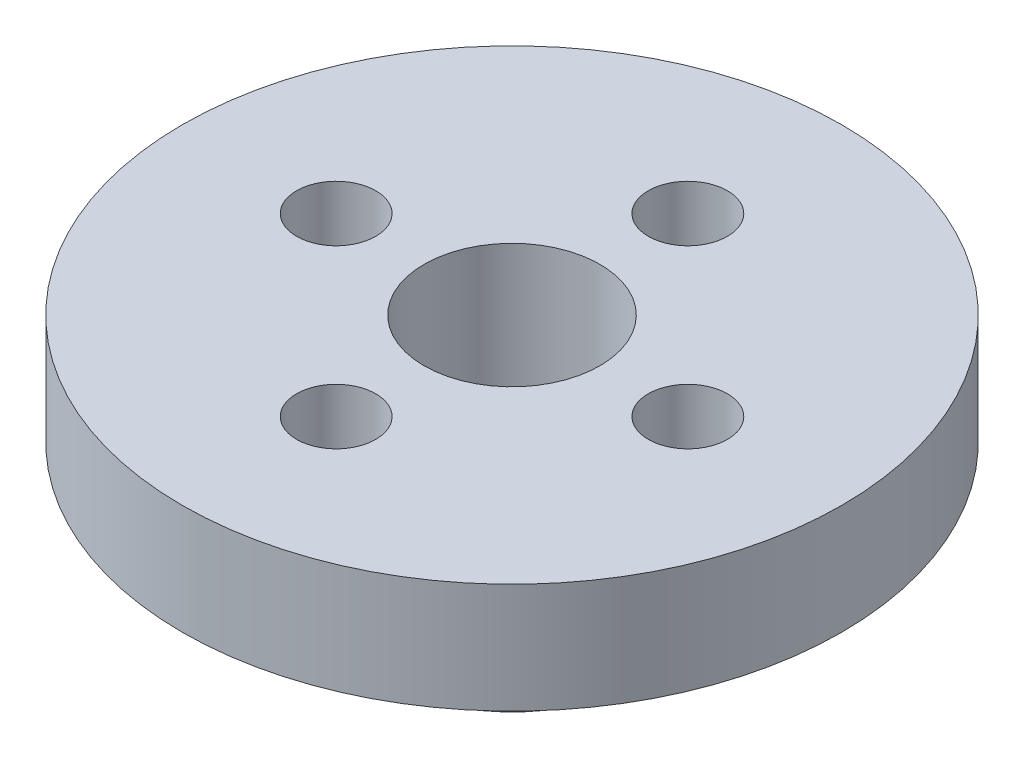
ISO-10303-21;
HEADER;
FILE_DESCRIPTION(('STEP AP214'),'2;1');
FILE_NAME('part.step','',(''),(''),'','','');
FILE_SCHEMA(('AUTOMOTIVE_DESIGN { 1 0 10303 214 1 1 1 1 }'));
ENDSEC;
DATA;
#1=APPLICATION_CONTEXT('core data for automotive mechanical design processes');
#2=APPLICATION_PROTOCOL_DEFINITION('international standard','automotive_design',2000,#1);
#3=PRODUCT_CONTEXT('',#1,'mechanical');
#4=PRODUCT('Part','Part','',(#3));
#5=PRODUCT_RELATED_PRODUCT_CATEGORY('part','',(#4));
#6=PRODUCT_DEFINITION_FORMATION('','',#4);
#7=PRODUCT_DEFINITION_CONTEXT('part definition',#1,'design');
#8=PRODUCT_DEFINITION('design','',#6,#7);
#9=PRODUCT_DEFINITION_SHAPE('','',#8);
#10=(LENGTH_UNIT() NAMED_UNIT(*) SI_UNIT(.MILLI.,.METRE.));
#11=(NAMED_UNIT(*) PLANE_ANGLE_UNIT() SI_UNIT($,.RADIAN.));
#12=(NAMED_UNIT(*) SI_UNIT($,.STERADIAN.) SOLID_ANGLE_UNIT());
#13=UNCERTAINTY_MEASURE_WITH_UNIT(LENGTH_MEASURE(1.E-05),#10,'distance_accuracy_value','');
#14=(GEOMETRIC_REPRESENTATION_CONTEXT(3) GLOBAL_UNCERTAINTY_ASSIGNED_CONTEXT((#13)) GLOBAL_UNIT_ASSIGNED_CONTEXT((#10,
#11,#12)) REPRESENTATION_CONTEXT('',''));
#15=CARTESIAN_POINT('',(0.,0.,0.));
#16=DIRECTION('',(0.,0.,1.));
#17=DIRECTION('',(1.,0.,0.));
#18=AXIS2_PLACEMENT_3D('',#15,#16,#17);
#19=CARTESIAN_POINT('',(0.,3.175,0.));
#20=DIRECTION('',(0.,-1.,0.));
#21=DIRECTION('',(0.,0.,-1.));
#22=AXIS2_PLACEMENT_3D('',#19,#20,#21);
#23=CYLINDRICAL_SURFACE('',#22,9.525);
#24=CARTESIAN_POINT('',(0.,3.175,0.));
#25=DIRECTION('',(0.,1.,0.));
#26=DIRECTION('',(0.,0.,1.));
#27=AXIS2_PLACEMENT_3D('',#24,#25,#26);
#28=CIRCLE('',#27,9.525);
#29=CARTESIAN_POINT('',(0.,3.175,9.525));
#30=VERTEX_POINT('',#29);
#31=EDGE_CURVE('E10',#30,#30,#28,.T.);
#32=ORIENTED_EDGE('',*,*,#31,.F.);
#33=EDGE_LOOP('',(#32));
#34=FACE_BOUND('',#33,.T.);
#35=CARTESIAN_POINT('',(0.,0.,0.));
#36=DIRECTION('',(0.,1.,0.));
#37=DIRECTION('',(0.,0.,1.));
#38=AXIS2_PLACEMENT_3D('',#35,#36,#37);
#39=CIRCLE('',#38,9.525);
#40=CARTESIAN_POINT('',(0.,0.,9.525));
#41=VERTEX_POINT('',#40);
#42=EDGE_CURVE('E40',#41,#41,#39,.T.);
#43=ORIENTED_EDGE('',*,*,#42,.T.);
#44=EDGE_LOOP('',(#43));
#45=FACE_BOUND('',#44,.T.);
#46=ADVANCED_FACE('F37',(#34,#45),#23,.T.);
#47=CARTESIAN_POINT('',(0.,3.175,0.));
#48=DIRECTION('',(0.,1.,0.));
#49=DIRECTION('',(0.,0.,1.));
#50=AXIS2_PLACEMENT_3D('',#47,#48,#49);
#51=PLANE('',#50);
#52=CARTESIAN_POINT('',(5.08,3.175,0.));
#53=DIRECTION('',(0.,1.,0.));
#54=DIRECTION('',(0.,0.,1.));
#55=AXIS2_PLACEMENT_3D('',#52,#53,#54);
#56=CIRCLE('',#55,1.143);
#57=CARTESIAN_POINT('',(5.08,3.175,1.143));
#58=VERTEX_POINT('',#57);
#59=EDGE_CURVE('E66',#58,#58,#56,.T.);
#60=ORIENTED_EDGE('',*,*,#59,.F.);
#61=EDGE_LOOP('',(#60));
#62=FACE_BOUND('',#61,.T.);
#63=CARTESIAN_POINT('',(0.,3.175,-5.08));
#64=DIRECTION('',(0.,1.,0.));
#65=DIRECTION('',(0.,0.,1.));
#66=AXIS2_PLACEMENT_3D('',#63,#64,#65);
#67=CIRCLE('',#66,1.143);
#68=CARTESIAN_POINT('',(0.,3.175,-3.937));
#69=VERTEX_POINT('',#68);
#70=EDGE_CURVE('E71',#69,#69,#67,.T.);
#71=ORIENTED_EDGE('',*,*,#70,.F.);
#72=EDGE_LOOP('',(#71));
#73=FACE_BOUND('',#72,.T.);
#74=CARTESIAN_POINT('',(-5.08,3.175,0.));
#75=DIRECTION('',(0.,1.,0.));
#76=DIRECTION('',(0.,0.,1.));
#77=AXIS2_PLACEMENT_3D('',#74,#75,#76);
#78=CIRCLE('',#77,1.143);
#79=CARTESIAN_POINT('',(-5.08,3.175,1.143));
#80=VERTEX_POINT('',#79);
#81=EDGE_CURVE('E72',#80,#80,#78,.T.);
#82=ORIENTED_EDGE('',*,*,#81,.F.);
#83=EDGE_LOOP('',(#82));
#84=FACE_BOUND('',#83,.T.);
#85=CARTESIAN_POINT('',(0.,3.175,5.08));
#86=DIRECTION('',(0.,1.,0.));
#87=DIRECTION('',(0.,0.,1.));
#88=AXIS2_PLACEMENT_3D('',#85,#86,#87);
#89=CIRCLE('',#88,1.143);
#90=CARTESIAN_POINT('',(0.,3.175,6.223));
#91=VERTEX_POINT('',#90);
#92=EDGE_CURVE('E87',#91,#91,#89,.T.);
#93=ORIENTED_EDGE('',*,*,#92,.F.);
#94=EDGE_LOOP('',(#93));
#95=FACE_BOUND('',#94,.T.);
#96=CARTESIAN_POINT('',(0.,3.175,0.));
#97=DIRECTION('',(0.,1.,0.));
#98=DIRECTION('',(0.,0.,1.));
#99=AXIS2_PLACEMENT_3D('',#96,#97,#98);
#100=CIRCLE('',#99,2.54);
#101=CARTESIAN_POINT('',(0.,3.175,2.54));
#102=VERTEX_POINT('',#101);
#103=EDGE_CURVE('E62',#102,#102,#100,.T.);
#104=ORIENTED_EDGE('',*,*,#103,.F.);
#105=EDGE_LOOP('',(#104));
#106=FACE_BOUND('',#105,.T.);
#107=ORIENTED_EDGE('',*,*,#31,.T.);
#108=EDGE_LOOP('',(#107));
#109=FACE_BOUND('',#108,.T.);
#110=ADVANCED_FACE('F102',(#62,#73,#84,#95,#106,#109),#51,.T.);
#111=CARTESIAN_POINT('',(0.,0.,0.));
#112=DIRECTION('',(0.,1.,0.));
#113=DIRECTION('',(0.,0.,1.));
#114=AXIS2_PLACEMENT_3D('',#111,#112,#113);
#115=PLANE('',#114);
#116=CARTESIAN_POINT('',(5.08,0.,0.));
#117=DIRECTION('',(0.,1.,0.));
#118=DIRECTION('',(0.,0.,1.));
#119=AXIS2_PLACEMENT_3D('',#116,#117,#118);
#120=CIRCLE('',#119,1.143);
#121=CARTESIAN_POINT('',(5.08,0.,1.143));
#122=VERTEX_POINT('',#121);
#123=EDGE_CURVE('E76',#122,#122,#120,.T.);
#124=ORIENTED_EDGE('',*,*,#123,.T.);
#125=EDGE_LOOP('',(#124));
#126=FACE_BOUND('',#125,.T.);
#127=CARTESIAN_POINT('',(0.,0.,-5.08));
#128=DIRECTION('',(0.,1.,0.));
#129=DIRECTION('',(0.,0.,1.));
#130=AXIS2_PLACEMENT_3D('',#127,#128,#129);
#131=CIRCLE('',#130,1.143);
#132=CARTESIAN_POINT('',(0.,0.,-3.937));
#133=VERTEX_POINT('',#132);
#134=EDGE_CURVE('E67',#133,#133,#131,.T.);
#135=ORIENTED_EDGE('',*,*,#134,.T.);
#136=EDGE_LOOP('',(#135));
#137=FACE_BOUND('',#136,.T.);
#138=CARTESIAN_POINT('',(-5.08,0.,0.));
#139=DIRECTION('',(0.,1.,0.));
#140=DIRECTION('',(0.,0.,1.));
#141=AXIS2_PLACEMENT_3D('',#138,#139,#140);
#142=CIRCLE('',#141,1.143);
#143=CARTESIAN_POINT('',(-5.08,0.,1.143));
#144=VERTEX_POINT('',#143);
#145=EDGE_CURVE('E91',#144,#144,#142,.T.);
#146=ORIENTED_EDGE('',*,*,#145,.T.);
#147=EDGE_LOOP('',(#146));
#148=FACE_BOUND('',#147,.T.);
#149=CARTESIAN_POINT('',(0.,0.,5.08));
#150=DIRECTION('',(0.,1.,0.));
#151=DIRECTION('',(0.,0.,1.));
#152=AXIS2_PLACEMENT_3D('',#149,#150,#151);
#153=CIRCLE('',#152,1.143);
#154=CARTESIAN_POINT('',(0.,0.,6.223));
#155=VERTEX_POINT('',#154);
#156=EDGE_CURVE('E83',#155,#155,#153,.T.);
#157=ORIENTED_EDGE('',*,*,#156,.T.);
#158=EDGE_LOOP('',(#157));
#159=FACE_BOUND('',#158,.T.);
#160=CARTESIAN_POINT('',(0.,0.,0.));
#161=DIRECTION('',(0.,1.,0.));
#162=DIRECTION('',(0.,0.,1.));
#163=AXIS2_PLACEMENT_3D('',#160,#161,#162);
#164=CIRCLE('',#163,3.81);
#165=CARTESIAN_POINT('',(0.,0.,3.81));
#166=VERTEX_POINT('',#165);
#167=EDGE_CURVE('E51',#166,#166,#164,.T.);
#168=ORIENTED_EDGE('',*,*,#167,.T.);
#169=EDGE_LOOP('',(#168));
#170=FACE_BOUND('',#169,.T.);
#171=ORIENTED_EDGE('',*,*,#42,.F.);
#172=EDGE_LOOP('',(#171));
#173=FACE_BOUND('',#172,.T.);
#174=ADVANCED_FACE('F105',(#126,#137,#148,#159,#170,#173),#115,.F.);
#175=CARTESIAN_POINT('',(0.,-4.064,0.));
#176=DIRECTION('',(0.,1.,0.));
#177=DIRECTION('',(0.,0.,1.));
#178=AXIS2_PLACEMENT_3D('',#175,#176,#177);
#179=CYLINDRICAL_SURFACE('',#178,3.81);
#180=CARTESIAN_POINT('',(0.,-4.064,0.));
#181=DIRECTION('',(0.,1.,0.));
#182=DIRECTION('',(0.,0.,1.));
#183=AXIS2_PLACEMENT_3D('',#180,#181,#182);
#184=CIRCLE('',#183,3.81);
#185=CARTESIAN_POINT('',(0.,-4.064,3.81));
#186=VERTEX_POINT('',#185);
#187=EDGE_CURVE('E49',#186,#186,#184,.T.);
#188=ORIENTED_EDGE('',*,*,#187,.T.);
#189=EDGE_LOOP('',(#188));
#190=FACE_BOUND('',#189,.T.);
#191=ORIENTED_EDGE('',*,*,#167,.F.);
#192=EDGE_LOOP('',(#191));
#193=FACE_BOUND('',#192,.T.);
#194=ADVANCED_FACE('F124',(#190,#193),#179,.T.);
#195=CARTESIAN_POINT('',(0.,-4.064,0.));
#196=DIRECTION('',(0.,1.,0.));
#197=DIRECTION('',(0.,0.,1.));
#198=AXIS2_PLACEMENT_3D('',#195,#196,#197);
#199=PLANE('',#198);
#200=CARTESIAN_POINT('',(0.,-4.064,0.));
#201=DIRECTION('',(0.,1.,0.));
#202=DIRECTION('',(0.,0.,1.));
#203=AXIS2_PLACEMENT_3D('',#200,#201,#202);
#204=CIRCLE('',#203,2.54);
#205=CARTESIAN_POINT('',(0.,-4.064,2.54));
#206=VERTEX_POINT('',#205);
#207=EDGE_CURVE('E55',#206,#206,#204,.T.);
#208=ORIENTED_EDGE('',*,*,#207,.T.);
#209=EDGE_LOOP('',(#208));
#210=FACE_BOUND('',#209,.T.);
#211=ORIENTED_EDGE('',*,*,#187,.F.);
#212=EDGE_LOOP('',(#211));
#213=FACE_BOUND('',#212,.T.);
#214=ADVANCED_FACE('F115',(#210,#213),#199,.F.);
#215=CARTESIAN_POINT('',(0.,-4.064,0.));
#216=DIRECTION('',(0.,1.,0.));
#217=DIRECTION('',(0.,0.,1.));
#218=AXIS2_PLACEMENT_3D('',#215,#216,#217);
#219=CYLINDRICAL_SURFACE('',#218,2.54);
#220=ORIENTED_EDGE('',*,*,#207,.F.);
#221=EDGE_LOOP('',(#220));
#222=FACE_BOUND('',#221,.T.);
#223=ORIENTED_EDGE('',*,*,#103,.T.);
#224=EDGE_LOOP('',(#223));
#225=FACE_BOUND('',#224,.T.);
#226=ADVANCED_FACE('F112',(#222,#225),#219,.F.);
#227=CARTESIAN_POINT('',(0.,3.175,5.08));
#228=DIRECTION('',(0.,-1.,0.));
#229=DIRECTION('',(0.,0.,-1.));
#230=AXIS2_PLACEMENT_3D('',#227,#228,#229);
#231=CYLINDRICAL_SURFACE('',#230,1.143);
#232=ORIENTED_EDGE('',*,*,#92,.T.);
#233=EDGE_LOOP('',(#232));
#234=FACE_BOUND('',#233,.T.);
#235=ORIENTED_EDGE('',*,*,#156,.F.);
#236=EDGE_LOOP('',(#235));
#237=FACE_BOUND('',#236,.T.);
#238=ADVANCED_FACE('F114',(#234,#237),#231,.F.);
#239=CARTESIAN_POINT('',(-5.08,3.175,0.));
#240=DIRECTION('',(0.,-1.,0.));
#241=DIRECTION('',(0.,0.,-1.));
#242=AXIS2_PLACEMENT_3D('',#239,#240,#241);
#243=CYLINDRICAL_SURFACE('',#242,1.143);
#244=ORIENTED_EDGE('',*,*,#81,.T.);
#245=EDGE_LOOP('',(#244));
#246=FACE_BOUND('',#245,.T.);
#247=ORIENTED_EDGE('',*,*,#145,.F.);
#248=EDGE_LOOP('',(#247));
#249=FACE_BOUND('',#248,.T.);
#250=ADVANCED_FACE('F99',(#246,#249),#243,.F.);
#251=CARTESIAN_POINT('',(0.,3.175,-5.08));
#252=DIRECTION('',(0.,-1.,0.));
#253=DIRECTION('',(0.,0.,-1.));
#254=AXIS2_PLACEMENT_3D('',#251,#252,#253);
#255=CYLINDRICAL_SURFACE('',#254,1.143);
#256=ORIENTED_EDGE('',*,*,#70,.T.);
#257=EDGE_LOOP('',(#256));
#258=FACE_BOUND('',#257,.T.);
#259=ORIENTED_EDGE('',*,*,#134,.F.);
#260=EDGE_LOOP('',(#259));
#261=FACE_BOUND('',#260,.T.);
#262=ADVANCED_FACE('F155',(#258,#261),#255,.F.);
#263=CARTESIAN_POINT('',(5.08,3.175,0.));
#264=DIRECTION('',(0.,-1.,0.));
#265=DIRECTION('',(0.,0.,-1.));
#266=AXIS2_PLACEMENT_3D('',#263,#264,#265);
#267=CYLINDRICAL_SURFACE('',#266,1.143);
#268=ORIENTED_EDGE('',*,*,#59,.T.);
#269=EDGE_LOOP('',(#268));
#270=FACE_BOUND('',#269,.T.);
#271=ORIENTED_EDGE('',*,*,#123,.F.);
#272=EDGE_LOOP('',(#271));
#273=FACE_BOUND('',#272,.T.);
#274=ADVANCED_FACE('F160',(#270,#273),#267,.F.);
#275=CLOSED_SHELL('',(#46,#110,#174,#194,#214,#226,#238,#250,#262,#274));
#276=MANIFOLD_SOLID_BREP('B2',#275);
#277=ADVANCED_BREP_SHAPE_REPRESENTATION('',(#18,#276),#14);
#278=SHAPE_DEFINITION_REPRESENTATION(#9,#277);
ENDSEC;
END-ISO-10303-21;
